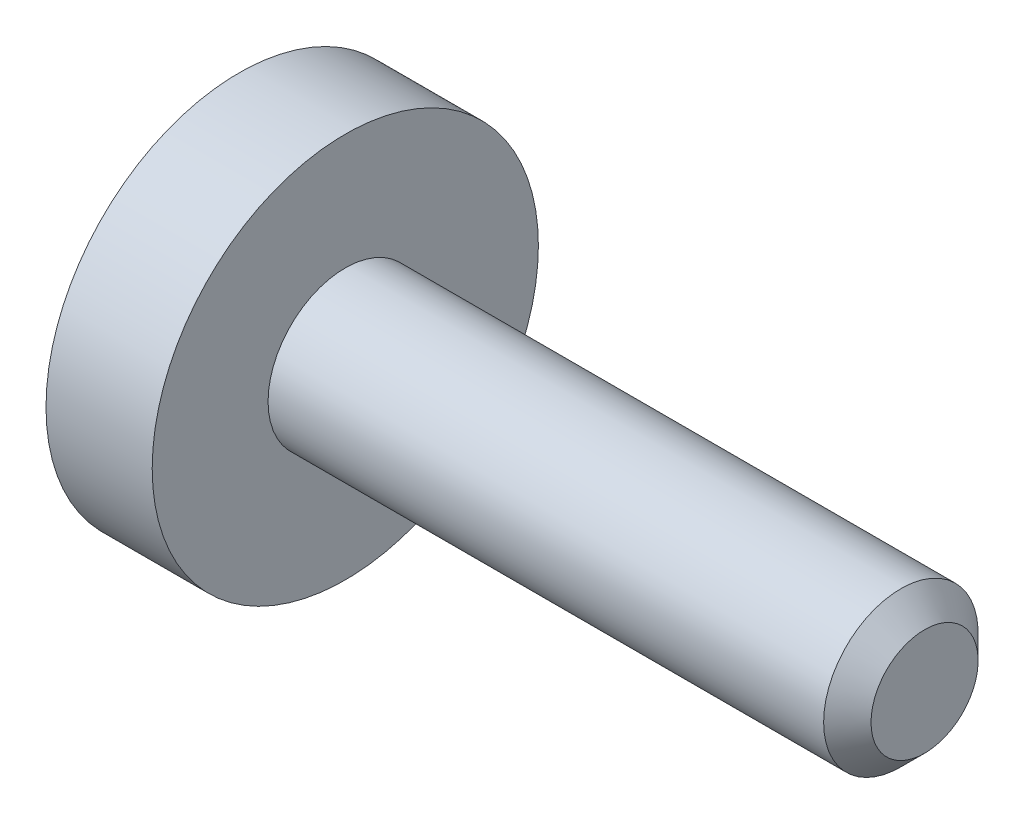
ISO-10303-21;
HEADER;
FILE_DESCRIPTION(('STEP AP214'),'2;1');
FILE_NAME('part.step','',(''),(''),'','','');
FILE_SCHEMA(('AUTOMOTIVE_DESIGN { 1 0 10303 214 1 1 1 1 }'));
ENDSEC;
DATA;
#1=APPLICATION_CONTEXT('core data for automotive mechanical design processes');
#2=APPLICATION_PROTOCOL_DEFINITION('international standard','automotive_design',2000,#1);
#3=PRODUCT_CONTEXT('',#1,'mechanical');
#4=PRODUCT('Part','Part','',(#3));
#5=PRODUCT_RELATED_PRODUCT_CATEGORY('part','',(#4));
#6=PRODUCT_DEFINITION_FORMATION('','',#4);
#7=PRODUCT_DEFINITION_CONTEXT('part definition',#1,'design');
#8=PRODUCT_DEFINITION('design','',#6,#7);
#9=PRODUCT_DEFINITION_SHAPE('','',#8);
#10=(LENGTH_UNIT() NAMED_UNIT(*) SI_UNIT(.MILLI.,.METRE.));
#11=(NAMED_UNIT(*) PLANE_ANGLE_UNIT() SI_UNIT($,.RADIAN.));
#12=(NAMED_UNIT(*) SI_UNIT($,.STERADIAN.) SOLID_ANGLE_UNIT());
#13=UNCERTAINTY_MEASURE_WITH_UNIT(LENGTH_MEASURE(1.E-05),#10,'distance_accuracy_value','');
#14=(GEOMETRIC_REPRESENTATION_CONTEXT(3) GLOBAL_UNCERTAINTY_ASSIGNED_CONTEXT((#13)) GLOBAL_UNIT_ASSIGNED_CONTEXT((#10,
#11,#12)) REPRESENTATION_CONTEXT('',''));
#15=CARTESIAN_POINT('',(0.,0.,0.));
#16=DIRECTION('',(0.,0.,1.));
#17=DIRECTION('',(1.,0.,0.));
#18=AXIS2_PLACEMENT_3D('',#15,#16,#17);
#19=CARTESIAN_POINT('',(-1.1,0.,0.));
#20=DIRECTION('',(1.,0.,0.));
#21=DIRECTION('',(0.,0.,-1.));
#22=AXIS2_PLACEMENT_3D('',#19,#20,#21);
#23=PLANE('',#22);
#24=CARTESIAN_POINT('',(-1.1,0.,0.));
#25=DIRECTION('',(-1.,0.,0.));
#26=DIRECTION('',(0.,0.,1.));
#27=AXIS2_PLACEMENT_3D('',#24,#25,#26);
#28=CIRCLE('',#27,2.);
#29=CARTESIAN_POINT('',(-1.1,0.,2.));
#30=VERTEX_POINT('',#29);
#31=EDGE_CURVE('E11',#30,#30,#28,.T.);
#32=ORIENTED_EDGE('',*,*,#31,.T.);
#33=EDGE_LOOP('',(#32));
#34=FACE_BOUND('',#33,.T.);
#35=DIRECTION('',(0.,-1.,0.));
#36=VECTOR('',#35,1.);
#37=CARTESIAN_POINT('',(-1.1,0.37527767497326,0.65));
#38=LINE('',#37,#36);
#39=CARTESIAN_POINT('',(-1.1,0.37527767497326,0.65));
#40=VERTEX_POINT('',#39);
#41=CARTESIAN_POINT('',(-1.1,-0.37527767497326,0.65));
#42=VERTEX_POINT('',#41);
#43=EDGE_CURVE('E53',#40,#42,#38,.T.);
#44=ORIENTED_EDGE('',*,*,#43,.T.);
#45=DIRECTION('',(0.,-0.499999999999993,-0.866025403784442));
#46=VECTOR('',#45,1.);
#47=CARTESIAN_POINT('',(-1.1,-0.37527767497326,0.65));
#48=LINE('',#47,#46);
#49=CARTESIAN_POINT('',(-1.1,-0.75055534994651,0.));
#50=VERTEX_POINT('',#49);
#51=EDGE_CURVE('E124',#42,#50,#48,.T.);
#52=ORIENTED_EDGE('',*,*,#51,.T.);
#53=DIRECTION('',(0.,0.499999999999993,-0.866025403784442));
#54=VECTOR('',#53,1.);
#55=CARTESIAN_POINT('',(-1.1,-0.75055534994651,0.));
#56=LINE('',#55,#54);
#57=CARTESIAN_POINT('',(-1.1,-0.37527767497326,-0.65));
#58=VERTEX_POINT('',#57);
#59=EDGE_CURVE('E127',#50,#58,#56,.T.);
#60=ORIENTED_EDGE('',*,*,#59,.T.);
#61=DIRECTION('',(0.,1.,0.));
#62=VECTOR('',#61,1.);
#63=CARTESIAN_POINT('',(-1.1,-0.37527767497326,-0.65));
#64=LINE('',#63,#62);
#65=CARTESIAN_POINT('',(-1.1,0.37527767497326,-0.65));
#66=VERTEX_POINT('',#65);
#67=EDGE_CURVE('E130',#58,#66,#64,.T.);
#68=ORIENTED_EDGE('',*,*,#67,.T.);
#69=DIRECTION('',(0.,0.499999999999993,0.866025403784442));
#70=VECTOR('',#69,1.);
#71=CARTESIAN_POINT('',(-1.1,0.37527767497326,-0.65));
#72=LINE('',#71,#70);
#73=CARTESIAN_POINT('',(-1.1,0.75055534994651,0.));
#74=VERTEX_POINT('',#73);
#75=EDGE_CURVE('E114',#66,#74,#72,.T.);
#76=ORIENTED_EDGE('',*,*,#75,.T.);
#77=DIRECTION('',(0.,-0.499999999999993,0.866025403784442));
#78=VECTOR('',#77,1.);
#79=CARTESIAN_POINT('',(-1.1,0.75055534994651,0.));
#80=LINE('',#79,#78);
#81=EDGE_CURVE('E133',#74,#40,#80,.T.);
#82=ORIENTED_EDGE('',*,*,#81,.T.);
#83=EDGE_LOOP('',(#44,#52,#60,#68,#76,#82));
#84=FACE_BOUND('',#83,.T.);
#85=ADVANCED_FACE('F39',(#34,#84),#23,.F.);
#86=CARTESIAN_POINT('',(6.,0.,0.));
#87=DIRECTION('',(-1.,0.,0.));
#88=DIRECTION('',(0.,0.,1.));
#89=AXIS2_PLACEMENT_3D('',#86,#87,#88);
#90=CYLINDRICAL_SURFACE('',#89,2.);
#91=ORIENTED_EDGE('',*,*,#31,.F.);
#92=EDGE_LOOP('',(#91));
#93=FACE_BOUND('',#92,.T.);
#94=CARTESIAN_POINT('',(0.,0.,0.));
#95=DIRECTION('',(-1.,0.,0.));
#96=DIRECTION('',(0.,0.,1.));
#97=AXIS2_PLACEMENT_3D('',#94,#95,#96);
#98=CIRCLE('',#97,2.);
#99=CARTESIAN_POINT('',(0.,0.,2.));
#100=VERTEX_POINT('',#99);
#101=EDGE_CURVE('E46',#100,#100,#98,.T.);
#102=ORIENTED_EDGE('',*,*,#101,.T.);
#103=EDGE_LOOP('',(#102));
#104=FACE_BOUND('',#103,.T.);
#105=ADVANCED_FACE('F155',(#93,#104),#90,.T.);
#106=CARTESIAN_POINT('',(0.,2.,0.));
#107=DIRECTION('',(-1.,0.,0.));
#108=DIRECTION('',(0.,0.,1.));
#109=AXIS2_PLACEMENT_3D('',#106,#107,#108);
#110=PLANE('',#109);
#111=ORIENTED_EDGE('',*,*,#101,.F.);
#112=EDGE_LOOP('',(#111));
#113=FACE_BOUND('',#112,.T.);
#114=CARTESIAN_POINT('',(0.,0.,0.));
#115=DIRECTION('',(-1.,0.,0.));
#116=DIRECTION('',(0.,0.,1.));
#117=AXIS2_PLACEMENT_3D('',#114,#115,#116);
#118=CIRCLE('',#117,0.8);
#119=CARTESIAN_POINT('',(0.,0.,0.8));
#120=VERTEX_POINT('',#119);
#121=EDGE_CURVE('E150',#120,#120,#118,.T.);
#122=ORIENTED_EDGE('',*,*,#121,.T.);
#123=EDGE_LOOP('',(#122));
#124=FACE_BOUND('',#123,.T.);
#125=ADVANCED_FACE('F157',(#113,#124),#110,.F.);
#126=CARTESIAN_POINT('',(6.,0.,0.));
#127=DIRECTION('',(-1.,0.,0.));
#128=DIRECTION('',(0.,0.,1.));
#129=AXIS2_PLACEMENT_3D('',#126,#127,#128);
#130=CYLINDRICAL_SURFACE('',#129,0.8);
#131=ORIENTED_EDGE('',*,*,#121,.F.);
#132=EDGE_LOOP('',(#131));
#133=FACE_BOUND('',#132,.T.);
#134=CARTESIAN_POINT('',(5.7545,0.,0.));
#135=DIRECTION('',(-1.,0.,0.));
#136=DIRECTION('',(0.,0.,1.));
#137=AXIS2_PLACEMENT_3D('',#134,#135,#136);
#138=CIRCLE('',#137,0.800000000000001);
#139=CARTESIAN_POINT('',(5.7545,0.,0.800000000000001));
#140=VERTEX_POINT('',#139);
#141=EDGE_CURVE('E147',#140,#140,#138,.T.);
#142=ORIENTED_EDGE('',*,*,#141,.T.);
#143=EDGE_LOOP('',(#142));
#144=FACE_BOUND('',#143,.T.);
#145=ADVANCED_FACE('F160',(#133,#144),#130,.T.);
#146=CARTESIAN_POINT('',(6.,0.,0.));
#147=DIRECTION('',(-1.,0.,0.));
#148=DIRECTION('',(0.,0.,1.));
#149=AXIS2_PLACEMENT_3D('',#146,#147,#148);
#150=CONICAL_SURFACE('',#149,0.554500000000001,0.785398163397447);
#151=ORIENTED_EDGE('',*,*,#141,.F.);
#152=EDGE_LOOP('',(#151));
#153=FACE_BOUND('',#152,.T.);
#154=CARTESIAN_POINT('',(6.,0.,0.));
#155=DIRECTION('',(-1.,0.,0.));
#156=DIRECTION('',(0.,0.,1.));
#157=AXIS2_PLACEMENT_3D('',#154,#155,#156);
#158=CIRCLE('',#157,0.554500000000001);
#159=CARTESIAN_POINT('',(6.,0.,0.554500000000001));
#160=VERTEX_POINT('',#159);
#161=EDGE_CURVE('E144',#160,#160,#158,.T.);
#162=ORIENTED_EDGE('',*,*,#161,.T.);
#163=EDGE_LOOP('',(#162));
#164=FACE_BOUND('',#163,.T.);
#165=ADVANCED_FACE('F166',(#153,#164),#150,.T.);
#166=CARTESIAN_POINT('',(6.,0.554500000000001,0.));
#167=DIRECTION('',(-1.,0.,0.));
#168=DIRECTION('',(0.,0.,1.));
#169=AXIS2_PLACEMENT_3D('',#166,#167,#168);
#170=PLANE('',#169);
#171=ORIENTED_EDGE('',*,*,#161,.F.);
#172=EDGE_LOOP('',(#171));
#173=FACE_BOUND('',#172,.T.);
#174=ADVANCED_FACE('F172',(#173),#170,.F.);
#175=CARTESIAN_POINT('',(0.0999999999999998,0.37527767497326,0.65));
#176=DIRECTION('',(0.,0.,-1.));
#177=DIRECTION('',(-1.,0.,0.));
#178=AXIS2_PLACEMENT_3D('',#175,#176,#177);
#179=PLANE('',#178);
#180=ORIENTED_EDGE('',*,*,#43,.F.);
#181=DIRECTION('',(-1.,0.,0.));
#182=VECTOR('',#181,1.);
#183=CARTESIAN_POINT('',(0.0999999999999998,0.37527767497326,0.65));
#184=LINE('',#183,#182);
#185=CARTESIAN_POINT('',(0.0999999999999998,0.37527767497326,0.65));
#186=VERTEX_POINT('',#185);
#187=EDGE_CURVE('E119',#186,#40,#184,.T.);
#188=ORIENTED_EDGE('',*,*,#187,.F.);
#189=DIRECTION('',(0.,-1.,0.));
#190=VECTOR('',#189,1.);
#191=CARTESIAN_POINT('',(0.0999999999999998,0.37527767497326,0.65));
#192=LINE('',#191,#190);
#193=CARTESIAN_POINT('',(0.0999999999999998,-0.37527767497326,0.65));
#194=VERTEX_POINT('',#193);
#195=EDGE_CURVE('E136',#186,#194,#192,.T.);
#196=ORIENTED_EDGE('',*,*,#195,.T.);
#197=DIRECTION('',(-1.,0.,0.));
#198=VECTOR('',#197,1.);
#199=CARTESIAN_POINT('',(0.0999999999999998,-0.37527767497326,0.65));
#200=LINE('',#199,#198);
#201=EDGE_CURVE('E142',#194,#42,#200,.T.);
#202=ORIENTED_EDGE('',*,*,#201,.T.);
#203=EDGE_LOOP('',(#180,#188,#196,#202));
#204=FACE_BOUND('',#203,.T.);
#205=ADVANCED_FACE('F177',(#204),#179,.T.);
#206=CARTESIAN_POINT('',(0.0999999999999998,-0.37527767497326,0.65));
#207=DIRECTION('',(0.,0.866025403784443,-0.499999999999993));
#208=DIRECTION('',(0.,0.499999999999993,0.866025403784442));
#209=AXIS2_PLACEMENT_3D('',#206,#207,#208);
#210=PLANE('',#209);
#211=ORIENTED_EDGE('',*,*,#51,.F.);
#212=ORIENTED_EDGE('',*,*,#201,.F.);
#213=DIRECTION('',(0.,-0.499999999999993,-0.866025403784442));
#214=VECTOR('',#213,1.);
#215=CARTESIAN_POINT('',(0.0999999999999998,-0.37527767497326,0.65));
#216=LINE('',#215,#214);
#217=CARTESIAN_POINT('',(0.0999999999999998,-0.75055534994651,0.));
#218=VERTEX_POINT('',#217);
#219=EDGE_CURVE('E92',#194,#218,#216,.T.);
#220=ORIENTED_EDGE('',*,*,#219,.T.);
#221=DIRECTION('',(-1.,0.,0.));
#222=VECTOR('',#221,1.);
#223=CARTESIAN_POINT('',(0.0999999999999998,-0.75055534994651,0.));
#224=LINE('',#223,#222);
#225=EDGE_CURVE('E140',#218,#50,#224,.T.);
#226=ORIENTED_EDGE('',*,*,#225,.T.);
#227=EDGE_LOOP('',(#211,#212,#220,#226));
#228=FACE_BOUND('',#227,.T.);
#229=ADVANCED_FACE('F182',(#228),#210,.T.);
#230=CARTESIAN_POINT('',(0.0999999999999998,-0.75055534994651,0.));
#231=DIRECTION('',(0.,0.866025403784443,0.499999999999993));
#232=DIRECTION('',(0.,-0.499999999999993,0.866025403784442));
#233=AXIS2_PLACEMENT_3D('',#230,#231,#232);
#234=PLANE('',#233);
#235=ORIENTED_EDGE('',*,*,#59,.F.);
#236=ORIENTED_EDGE('',*,*,#225,.F.);
#237=DIRECTION('',(0.,0.499999999999993,-0.866025403784442));
#238=VECTOR('',#237,1.);
#239=CARTESIAN_POINT('',(0.0999999999999998,-0.75055534994651,0.));
#240=LINE('',#239,#238);
#241=CARTESIAN_POINT('',(0.0999999999999998,-0.37527767497326,-0.65));
#242=VERTEX_POINT('',#241);
#243=EDGE_CURVE('E110',#218,#242,#240,.T.);
#244=ORIENTED_EDGE('',*,*,#243,.T.);
#245=DIRECTION('',(-1.,0.,0.));
#246=VECTOR('',#245,1.);
#247=CARTESIAN_POINT('',(0.0999999999999998,-0.37527767497326,-0.65));
#248=LINE('',#247,#246);
#249=EDGE_CURVE('E107',#242,#58,#248,.T.);
#250=ORIENTED_EDGE('',*,*,#249,.T.);
#251=EDGE_LOOP('',(#235,#236,#244,#250));
#252=FACE_BOUND('',#251,.T.);
#253=ADVANCED_FACE('F199',(#252),#234,.T.);
#254=CARTESIAN_POINT('',(0.0999999999999998,-0.37527767497326,-0.65));
#255=DIRECTION('',(0.,0.,1.));
#256=DIRECTION('',(1.,0.,0.));
#257=AXIS2_PLACEMENT_3D('',#254,#255,#256);
#258=PLANE('',#257);
#259=ORIENTED_EDGE('',*,*,#67,.F.);
#260=ORIENTED_EDGE('',*,*,#249,.F.);
#261=DIRECTION('',(0.,1.,0.));
#262=VECTOR('',#261,1.);
#263=CARTESIAN_POINT('',(0.0999999999999998,-0.37527767497326,-0.65));
#264=LINE('',#263,#262);
#265=CARTESIAN_POINT('',(0.0999999999999998,0.37527767497326,-0.65));
#266=VERTEX_POINT('',#265);
#267=EDGE_CURVE('E102',#242,#266,#264,.T.);
#268=ORIENTED_EDGE('',*,*,#267,.T.);
#269=DIRECTION('',(-1.,0.,0.));
#270=VECTOR('',#269,1.);
#271=CARTESIAN_POINT('',(0.0999999999999998,0.37527767497326,-0.65));
#272=LINE('',#271,#270);
#273=EDGE_CURVE('E106',#266,#66,#272,.T.);
#274=ORIENTED_EDGE('',*,*,#273,.T.);
#275=EDGE_LOOP('',(#259,#260,#268,#274));
#276=FACE_BOUND('',#275,.T.);
#277=ADVANCED_FACE('F105',(#276),#258,.T.);
#278=CARTESIAN_POINT('',(0.0999999999999998,0.37527767497326,-0.65));
#279=DIRECTION('',(0.,-0.866025403784443,0.499999999999993));
#280=DIRECTION('',(0.,-0.499999999999993,-0.866025403784442));
#281=AXIS2_PLACEMENT_3D('',#278,#279,#280);
#282=PLANE('',#281);
#283=ORIENTED_EDGE('',*,*,#75,.F.);
#284=ORIENTED_EDGE('',*,*,#273,.F.);
#285=DIRECTION('',(0.,0.499999999999993,0.866025403784442));
#286=VECTOR('',#285,1.);
#287=CARTESIAN_POINT('',(0.0999999999999998,0.37527767497326,-0.65));
#288=LINE('',#287,#286);
#289=CARTESIAN_POINT('',(0.0999999999999998,0.75055534994651,0.));
#290=VERTEX_POINT('',#289);
#291=EDGE_CURVE('E109',#266,#290,#288,.T.);
#292=ORIENTED_EDGE('',*,*,#291,.T.);
#293=DIRECTION('',(-1.,0.,0.));
#294=VECTOR('',#293,1.);
#295=CARTESIAN_POINT('',(0.0999999999999998,0.75055534994651,0.));
#296=LINE('',#295,#294);
#297=EDGE_CURVE('E83',#290,#74,#296,.T.);
#298=ORIENTED_EDGE('',*,*,#297,.T.);
#299=EDGE_LOOP('',(#283,#284,#292,#298));
#300=FACE_BOUND('',#299,.T.);
#301=ADVANCED_FACE('F112',(#300),#282,.T.);
#302=CARTESIAN_POINT('',(0.0999999999999998,0.75055534994651,0.));
#303=DIRECTION('',(0.,-0.866025403784443,-0.499999999999993));
#304=DIRECTION('',(0.,0.499999999999993,-0.866025403784442));
#305=AXIS2_PLACEMENT_3D('',#302,#303,#304);
#306=PLANE('',#305);
#307=ORIENTED_EDGE('',*,*,#81,.F.);
#308=ORIENTED_EDGE('',*,*,#297,.F.);
#309=DIRECTION('',(0.,-0.499999999999993,0.866025403784442));
#310=VECTOR('',#309,1.);
#311=CARTESIAN_POINT('',(0.0999999999999998,0.75055534994651,0.));
#312=LINE('',#311,#310);
#313=EDGE_CURVE('E61',#290,#186,#312,.T.);
#314=ORIENTED_EDGE('',*,*,#313,.T.);
#315=ORIENTED_EDGE('',*,*,#187,.T.);
#316=EDGE_LOOP('',(#307,#308,#314,#315));
#317=FACE_BOUND('',#316,.T.);
#318=ADVANCED_FACE('F192',(#317),#306,.T.);
#319=CARTESIAN_POINT('',(0.0999999999999998,0.,0.));
#320=DIRECTION('',(1.,0.,0.));
#321=DIRECTION('',(0.,0.,-1.));
#322=AXIS2_PLACEMENT_3D('',#319,#320,#321);
#323=PLANE('',#322);
#324=ORIENTED_EDGE('',*,*,#195,.F.);
#325=ORIENTED_EDGE('',*,*,#313,.F.);
#326=ORIENTED_EDGE('',*,*,#291,.F.);
#327=ORIENTED_EDGE('',*,*,#267,.F.);
#328=ORIENTED_EDGE('',*,*,#243,.F.);
#329=ORIENTED_EDGE('',*,*,#219,.F.);
#330=EDGE_LOOP('',(#324,#325,#326,#327,#328,#329));
#331=FACE_BOUND('',#330,.T.);
#332=ADVANCED_FACE('F117',(#331),#323,.F.);
#333=CLOSED_SHELL('',(#85,#105,#125,#145,#165,#174,#205,#229,#253,#277,#301,#318,#332));
#334=MANIFOLD_SOLID_BREP('B2',#333);
#335=ADVANCED_BREP_SHAPE_REPRESENTATION('',(#18,#334),#14);
#336=SHAPE_DEFINITION_REPRESENTATION(#9,#335);
ENDSEC;
END-ISO-10303-21;
